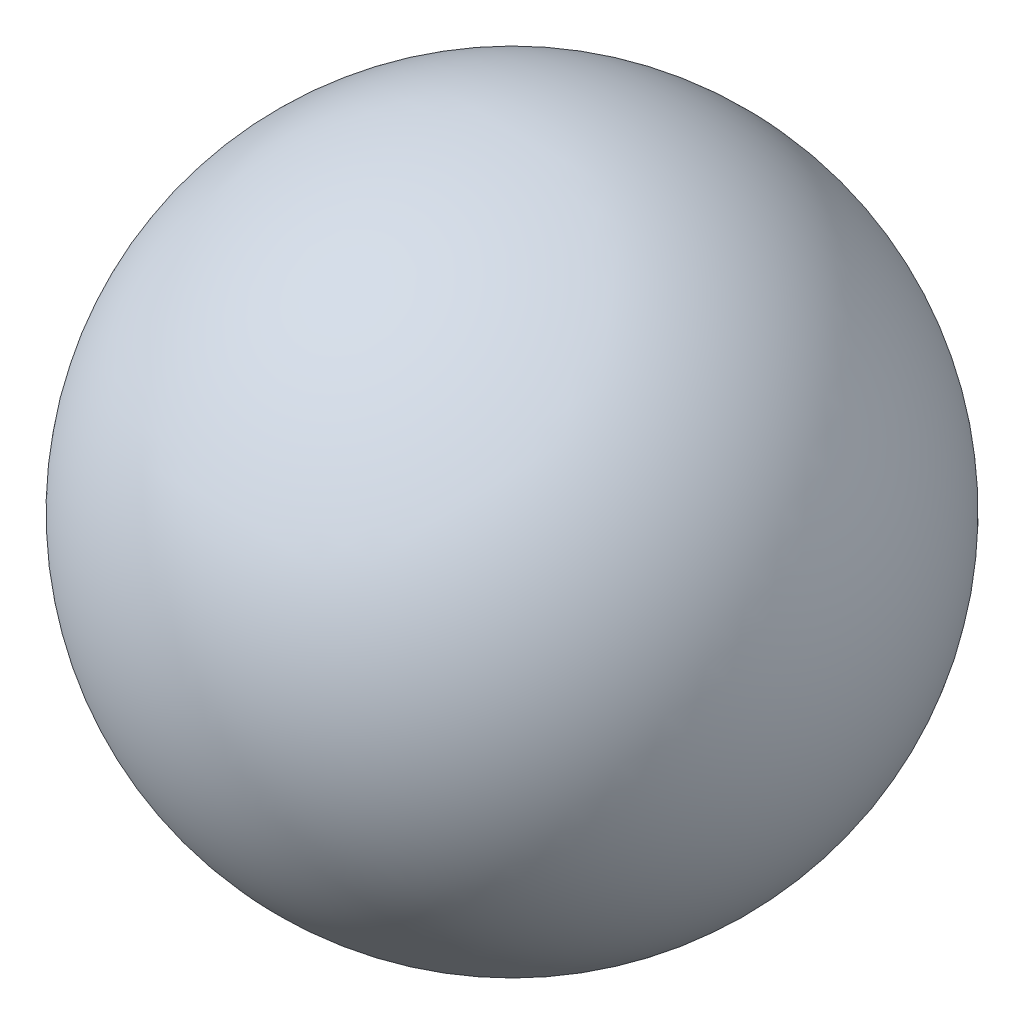
ISO-10303-21;
HEADER;
FILE_DESCRIPTION(('STEP AP214'),'2;1');
FILE_NAME('part.step','',(''),(''),'','','');
FILE_SCHEMA(('AUTOMOTIVE_DESIGN { 1 0 10303 214 1 1 1 1 }'));
ENDSEC;
DATA;
#1=APPLICATION_CONTEXT('core data for automotive mechanical design processes');
#2=APPLICATION_PROTOCOL_DEFINITION('international standard','automotive_design',2000,#1);
#3=PRODUCT_CONTEXT('',#1,'mechanical');
#4=PRODUCT('Part','Part','',(#3));
#5=PRODUCT_RELATED_PRODUCT_CATEGORY('part','',(#4));
#6=PRODUCT_DEFINITION_FORMATION('','',#4);
#7=PRODUCT_DEFINITION_CONTEXT('part definition',#1,'design');
#8=PRODUCT_DEFINITION('design','',#6,#7);
#9=PRODUCT_DEFINITION_SHAPE('','',#8);
#10=(LENGTH_UNIT() NAMED_UNIT(*) SI_UNIT(.MILLI.,.METRE.));
#11=(NAMED_UNIT(*) PLANE_ANGLE_UNIT() SI_UNIT($,.RADIAN.));
#12=(NAMED_UNIT(*) SI_UNIT($,.STERADIAN.) SOLID_ANGLE_UNIT());
#13=UNCERTAINTY_MEASURE_WITH_UNIT(LENGTH_MEASURE(1.E-05),#10,'distance_accuracy_value','');
#14=(GEOMETRIC_REPRESENTATION_CONTEXT(3) GLOBAL_UNCERTAINTY_ASSIGNED_CONTEXT((#13)) GLOBAL_UNIT_ASSIGNED_CONTEXT((#10,
#11,#12)) REPRESENTATION_CONTEXT('',''));
#15=CARTESIAN_POINT('',(0.,0.,0.));
#16=DIRECTION('',(0.,0.,1.));
#17=DIRECTION('',(1.,0.,0.));
#18=AXIS2_PLACEMENT_3D('',#15,#16,#17);
#19=CARTESIAN_POINT('',(64.16,-44.2547799821013,53.4370202924508));
#20=DIRECTION('',(0.,-0.637833186545712,0.770174542646628));
#21=DIRECTION('',(0.173648177666934,-0.758473860771031,-0.628143067238699));
#22=AXIS2_PLACEMENT_3D('',#19,#20,#21);
#23=SPHERICAL_SURFACE('',#22,7.15);
#24=CARTESIAN_POINT('',(64.16,-39.6942726982995,47.9302723125274));
#25=VERTEX_POINT('',#24);
#26=VERTEX_LOOP('',#25);
#27=FACE_BOUND('',#26,.T.);
#28=CARTESIAN_POINT('',(64.16,-48.8152872659031,58.9437682723742));
#29=VERTEX_POINT('',#28);
#30=VERTEX_LOOP('',#29);
#31=FACE_BOUND('',#30,.T.);
#32=ADVANCED_FACE('F16',(#27,#31),#23,.T.);
#33=CLOSED_SHELL('',(#32));
#34=MANIFOLD_SOLID_BREP('B1',#33);
#35=ADVANCED_BREP_SHAPE_REPRESENTATION('',(#18,#34),#14);
#36=SHAPE_DEFINITION_REPRESENTATION(#9,#35);
ENDSEC;
END-ISO-10303-21;
